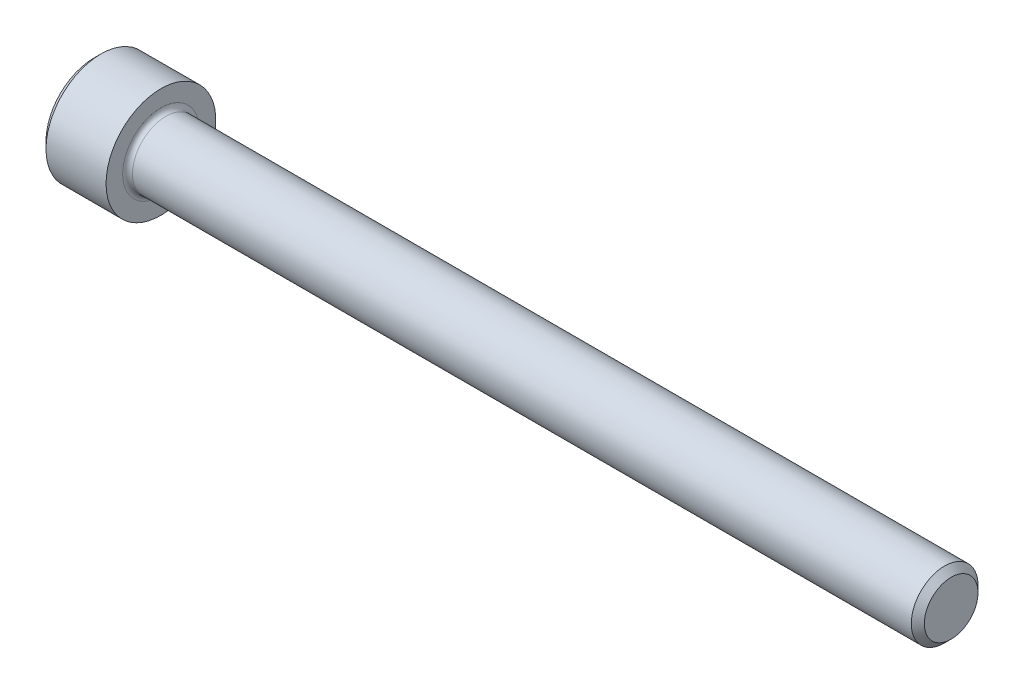
ISO-10303-21;
HEADER;
FILE_DESCRIPTION(('STEP AP214'),'2;1');
FILE_NAME('part.step','',(''),(''),'','','');
FILE_SCHEMA(('AUTOMOTIVE_DESIGN { 1 0 10303 214 1 1 1 1 }'));
ENDSEC;
DATA;
#1=APPLICATION_CONTEXT('core data for automotive mechanical design processes');
#2=APPLICATION_PROTOCOL_DEFINITION('international standard','automotive_design',2000,#1);
#3=PRODUCT_CONTEXT('',#1,'mechanical');
#4=PRODUCT('Part','Part','',(#3));
#5=PRODUCT_RELATED_PRODUCT_CATEGORY('part','',(#4));
#6=PRODUCT_DEFINITION_FORMATION('','',#4);
#7=PRODUCT_DEFINITION_CONTEXT('part definition',#1,'design');
#8=PRODUCT_DEFINITION('design','',#6,#7);
#9=PRODUCT_DEFINITION_SHAPE('','',#8);
#10=(LENGTH_UNIT() NAMED_UNIT(*) SI_UNIT(.MILLI.,.METRE.));
#11=(NAMED_UNIT(*) PLANE_ANGLE_UNIT() SI_UNIT($,.RADIAN.));
#12=(NAMED_UNIT(*) SI_UNIT($,.STERADIAN.) SOLID_ANGLE_UNIT());
#13=UNCERTAINTY_MEASURE_WITH_UNIT(LENGTH_MEASURE(1.E-05),#10,'distance_accuracy_value','');
#14=(GEOMETRIC_REPRESENTATION_CONTEXT(3) GLOBAL_UNCERTAINTY_ASSIGNED_CONTEXT((#13)) GLOBAL_UNIT_ASSIGNED_CONTEXT((#10,
#11,#12)) REPRESENTATION_CONTEXT('',''));
#15=CARTESIAN_POINT('',(0.,0.,0.));
#16=DIRECTION('',(0.,0.,1.));
#17=DIRECTION('',(1.,0.,0.));
#18=AXIS2_PLACEMENT_3D('',#15,#16,#17);
#19=CARTESIAN_POINT('',(2.286,1.14604605784412,1.98501000000003));
#20=DIRECTION('',(-1.,0.,0.));
#21=DIRECTION('',(0.,0.,1.));
#22=AXIS2_PLACEMENT_3D('',#19,#20,#21);
#23=PLANE('',#22);
#24=DIRECTION('',(0.,0.499999999999999,0.866025403784439));
#25=VECTOR('',#24,1.);
#26=CARTESIAN_POINT('',(2.286,-1.71906908676612,0.992505000000032));
#27=LINE('',#26,#25);
#28=CARTESIAN_POINT('',(2.28600000001322,-1.71906908676548,0.992504999999662));
#29=VERTEX_POINT('',#28);
#30=CARTESIAN_POINT('',(2.286,-1.14604605784409,1.98501));
#31=VERTEX_POINT('',#30);
#32=EDGE_CURVE('E99',#29,#31,#27,.T.);
#33=ORIENTED_EDGE('',*,*,#32,.T.);
#34=DIRECTION('',(0.,1.,0.));
#35=VECTOR('',#34,1.);
#36=CARTESIAN_POINT('',(2.286,1.14604605784412,1.98501));
#37=LINE('',#36,#35);
#38=CARTESIAN_POINT('',(2.28599999999801,0.,1.98501000002693));
#39=VERTEX_POINT('',#38);
#40=EDGE_CURVE('E94',#31,#39,#37,.T.);
#41=ORIENTED_EDGE('',*,*,#40,.T.);
#42=CARTESIAN_POINT('',(2.28600000002643,0.,0.));
#43=DIRECTION('',(-1.,0.,0.));
#44=DIRECTION('',(0.,0.,1.));
#45=AXIS2_PLACEMENT_3D('',#42,#43,#44);
#46=CIRCLE('',#45,1.98500999999851);
#47=EDGE_CURVE('E96',#39,#29,#46,.F.);
#48=ORIENTED_EDGE('',*,*,#47,.T.);
#49=EDGE_LOOP('',(#33,#41,#48));
#50=FACE_BOUND('',#49,.T.);
#51=ADVANCED_FACE('F16',(#50),#23,.T.);
#52=CARTESIAN_POINT('',(2.286,1.14604605784412,1.98501000000003));
#53=DIRECTION('',(-1.,0.,0.));
#54=DIRECTION('',(0.,0.,1.));
#55=AXIS2_PLACEMENT_3D('',#52,#53,#54);
#56=PLANE('',#55);
#57=DIRECTION('',(0.,-0.499999999999978,0.866025403784451));
#58=VECTOR('',#57,1.);
#59=CARTESIAN_POINT('',(2.286,-1.71906908676615,-0.992504999999998));
#60=LINE('',#59,#58);
#61=CARTESIAN_POINT('',(2.28600000001322,-1.7190690867655,-0.992504999999627));
#62=VERTEX_POINT('',#61);
#63=CARTESIAN_POINT('',(2.286,-2.2920921156882,0.));
#64=VERTEX_POINT('',#63);
#65=EDGE_CURVE('E103',#62,#64,#60,.T.);
#66=ORIENTED_EDGE('',*,*,#65,.T.);
#67=DIRECTION('',(0.,0.500000000000031,0.866025403784421));
#68=VECTOR('',#67,1.);
#69=CARTESIAN_POINT('',(2.286,-2.2920921156882,0.));
#70=LINE('',#69,#68);
#71=EDGE_CURVE('E170',#64,#29,#70,.T.);
#72=ORIENTED_EDGE('',*,*,#71,.T.);
#73=CARTESIAN_POINT('',(2.28600000002643,0.,0.));
#74=DIRECTION('',(-1.,0.,0.));
#75=DIRECTION('',(0.,0.,1.));
#76=AXIS2_PLACEMENT_3D('',#73,#74,#75);
#77=CIRCLE('',#76,1.98500999999851);
#78=EDGE_CURVE('E115',#29,#62,#77,.F.);
#79=ORIENTED_EDGE('',*,*,#78,.T.);
#80=EDGE_LOOP('',(#66,#72,#79));
#81=FACE_BOUND('',#80,.T.);
#82=ADVANCED_FACE('F227',(#81),#56,.T.);
#83=CARTESIAN_POINT('',(2.286,1.14604605784412,1.98501000000003));
#84=DIRECTION('',(-1.,0.,0.));
#85=DIRECTION('',(0.,0.,1.));
#86=AXIS2_PLACEMENT_3D('',#83,#84,#85);
#87=PLANE('',#86);
#88=DIRECTION('',(0.,1.,0.));
#89=VECTOR('',#88,1.);
#90=CARTESIAN_POINT('',(2.286,1.14604605784412,-1.98500999999998));
#91=LINE('',#90,#89);
#92=CARTESIAN_POINT('',(2.28600000002082,-3.05260855546239E-12,-1.98500999995698));
#93=VERTEX_POINT('',#92);
#94=CARTESIAN_POINT('',(2.286,-1.1460460578441,-1.98500999999998));
#95=VERTEX_POINT('',#94);
#96=EDGE_CURVE('E165',#93,#95,#91,.F.);
#97=ORIENTED_EDGE('',*,*,#96,.T.);
#98=DIRECTION('',(0.,-0.500000000000002,0.866025403784438));
#99=VECTOR('',#98,1.);
#100=CARTESIAN_POINT('',(2.286,-1.1460460578441,-1.98501));
#101=LINE('',#100,#99);
#102=EDGE_CURVE('E160',#95,#62,#101,.T.);
#103=ORIENTED_EDGE('',*,*,#102,.T.);
#104=CARTESIAN_POINT('',(2.28600000002643,0.,0.));
#105=DIRECTION('',(-1.,0.,0.));
#106=DIRECTION('',(0.,0.,1.));
#107=AXIS2_PLACEMENT_3D('',#104,#105,#106);
#108=CIRCLE('',#107,1.98500999999851);
#109=EDGE_CURVE('E223',#62,#93,#108,.F.);
#110=ORIENTED_EDGE('',*,*,#109,.T.);
#111=EDGE_LOOP('',(#97,#103,#110));
#112=FACE_BOUND('',#111,.T.);
#113=ADVANCED_FACE('F229',(#112),#87,.T.);
#114=CARTESIAN_POINT('',(2.286,1.14604605784412,1.98501000000003));
#115=DIRECTION('',(-1.,0.,0.));
#116=DIRECTION('',(0.,0.,1.));
#117=AXIS2_PLACEMENT_3D('',#114,#115,#116);
#118=PLANE('',#117);
#119=DIRECTION('',(0.,-0.499999999999991,-0.866025403784444));
#120=VECTOR('',#119,1.);
#121=CARTESIAN_POINT('',(2.286,1.71906908676615,-0.992504999999987));
#122=LINE('',#121,#120);
#123=CARTESIAN_POINT('',(2.28600000001321,1.71906908676551,-0.992504999999615));
#124=VERTEX_POINT('',#123);
#125=CARTESIAN_POINT('',(2.286,1.14604605784411,-1.98501));
#126=VERTEX_POINT('',#125);
#127=EDGE_CURVE('E155',#124,#126,#122,.T.);
#128=ORIENTED_EDGE('',*,*,#127,.T.);
#129=DIRECTION('',(0.,1.,0.));
#130=VECTOR('',#129,1.);
#131=CARTESIAN_POINT('',(2.286,1.14604605784412,-1.98501));
#132=LINE('',#131,#130);
#133=EDGE_CURVE('E150',#126,#93,#132,.F.);
#134=ORIENTED_EDGE('',*,*,#133,.T.);
#135=CARTESIAN_POINT('',(2.28600000002643,0.,0.));
#136=DIRECTION('',(-1.,0.,0.));
#137=DIRECTION('',(0.,0.,1.));
#138=AXIS2_PLACEMENT_3D('',#135,#136,#137);
#139=CIRCLE('',#138,1.98500999999851);
#140=EDGE_CURVE('E220',#93,#124,#139,.F.);
#141=ORIENTED_EDGE('',*,*,#140,.T.);
#142=EDGE_LOOP('',(#128,#134,#141));
#143=FACE_BOUND('',#142,.T.);
#144=ADVANCED_FACE('F234',(#143),#118,.T.);
#145=CARTESIAN_POINT('',(2.286,1.14604605784412,1.98501000000003));
#146=DIRECTION('',(-1.,0.,0.));
#147=DIRECTION('',(0.,0.,1.));
#148=AXIS2_PLACEMENT_3D('',#145,#146,#147);
#149=PLANE('',#148);
#150=DIRECTION('',(0.,0.500000000000002,-0.866025403784437));
#151=VECTOR('',#150,1.);
#152=CARTESIAN_POINT('',(2.286,1.71906908676615,0.992504999999998));
#153=LINE('',#152,#151);
#154=CARTESIAN_POINT('',(2.28600000001321,1.71906908676551,0.992504999999624));
#155=VERTEX_POINT('',#154);
#156=CARTESIAN_POINT('',(2.286,2.2920921156882,0.));
#157=VERTEX_POINT('',#156);
#158=EDGE_CURVE('E145',#155,#157,#153,.T.);
#159=ORIENTED_EDGE('',*,*,#158,.T.);
#160=DIRECTION('',(0.,-0.500000000000006,-0.866025403784435));
#161=VECTOR('',#160,1.);
#162=CARTESIAN_POINT('',(2.286,2.2920921156882,0.));
#163=LINE('',#162,#161);
#164=EDGE_CURVE('E116',#157,#124,#163,.T.);
#165=ORIENTED_EDGE('',*,*,#164,.T.);
#166=CARTESIAN_POINT('',(2.28600000002643,0.,0.));
#167=DIRECTION('',(-1.,0.,0.));
#168=DIRECTION('',(0.,0.,1.));
#169=AXIS2_PLACEMENT_3D('',#166,#167,#168);
#170=CIRCLE('',#169,1.98500999999851);
#171=EDGE_CURVE('E123',#124,#155,#170,.F.);
#172=ORIENTED_EDGE('',*,*,#171,.T.);
#173=EDGE_LOOP('',(#159,#165,#172));
#174=FACE_BOUND('',#173,.T.);
#175=ADVANCED_FACE('F236',(#174),#149,.T.);
#176=CARTESIAN_POINT('',(2.28600000002643,0.,0.));
#177=DIRECTION('',(-1.,0.,0.));
#178=DIRECTION('',(0.,0.,1.));
#179=AXIS2_PLACEMENT_3D('',#176,#177,#178);
#180=CONICAL_SURFACE('',#179,1.98500999999851,1.04719755110507);
#181=CARTESIAN_POINT('',(3.43204605775327,0.,1.70530256582424E-10));
#182=VERTEX_POINT('',#181);
#183=VERTEX_LOOP('',#182);
#184=FACE_BOUND('',#183,.T.);
#185=ORIENTED_EDGE('',*,*,#47,.F.);
#186=CARTESIAN_POINT('',(2.28600000002643,0.,0.));
#187=DIRECTION('',(-1.,0.,0.));
#188=DIRECTION('',(0.,0.,1.));
#189=AXIS2_PLACEMENT_3D('',#186,#187,#188);
#190=CIRCLE('',#189,1.98500999999851);
#191=EDGE_CURVE('E111',#155,#39,#190,.F.);
#192=ORIENTED_EDGE('',*,*,#191,.F.);
#193=ORIENTED_EDGE('',*,*,#171,.F.);
#194=ORIENTED_EDGE('',*,*,#140,.F.);
#195=ORIENTED_EDGE('',*,*,#109,.F.);
#196=ORIENTED_EDGE('',*,*,#78,.F.);
#197=EDGE_LOOP('',(#185,#192,#193,#194,#195,#196));
#198=FACE_BOUND('',#197,.T.);
#199=ADVANCED_FACE('F109',(#184,#198),#180,.F.);
#200=CARTESIAN_POINT('',(2.286,1.14604605784412,1.98501000000003));
#201=DIRECTION('',(-1.,0.,0.));
#202=DIRECTION('',(0.,0.,1.));
#203=AXIS2_PLACEMENT_3D('',#200,#201,#202);
#204=PLANE('',#203);
#205=DIRECTION('',(0.,-1.,0.));
#206=VECTOR('',#205,1.);
#207=CARTESIAN_POINT('',(2.286,-1.14604605784409,1.98501));
#208=LINE('',#207,#206);
#209=CARTESIAN_POINT('',(2.286,1.14604605784411,1.98501));
#210=VERTEX_POINT('',#209);
#211=EDGE_CURVE('E120',#39,#210,#208,.F.);
#212=ORIENTED_EDGE('',*,*,#211,.T.);
#213=DIRECTION('',(0.,0.500000000000002,-0.866025403784438));
#214=VECTOR('',#213,1.);
#215=CARTESIAN_POINT('',(2.286,2.2920921156882,0.));
#216=LINE('',#215,#214);
#217=EDGE_CURVE('E122',#155,#210,#216,.F.);
#218=ORIENTED_EDGE('',*,*,#217,.F.);
#219=ORIENTED_EDGE('',*,*,#191,.T.);
#220=EDGE_LOOP('',(#212,#218,#219));
#221=FACE_BOUND('',#220,.T.);
#222=ADVANCED_FACE('F119',(#221),#204,.T.);
#223=CARTESIAN_POINT('',(2.286,2.2920921156882,0.));
#224=DIRECTION('',(0.,-0.866025403784438,-0.500000000000002));
#225=DIRECTION('',(0.,0.500000000000002,-0.866025403784438));
#226=AXIS2_PLACEMENT_3D('',#223,#224,#225);
#227=PLANE('',#226);
#228=ORIENTED_EDGE('',*,*,#217,.T.);
#229=DIRECTION('',(1.,0.,0.));
#230=VECTOR('',#229,1.);
#231=CARTESIAN_POINT('',(2.286,1.14604605784412,1.98501));
#232=LINE('',#231,#230);
#233=CARTESIAN_POINT('',(0.,1.14604605784411,1.98501000000001));
#234=VERTEX_POINT('',#233);
#235=EDGE_CURVE('E128',#210,#234,#232,.F.);
#236=ORIENTED_EDGE('',*,*,#235,.T.);
#237=DIRECTION('',(0.,-0.499999999999992,0.866025403784443));
#238=VECTOR('',#237,1.);
#239=CARTESIAN_POINT('',(0.,2.2920921156882,0.));
#240=LINE('',#239,#238);
#241=CARTESIAN_POINT('',(0.,2.2920921156882,0.));
#242=VERTEX_POINT('',#241);
#243=EDGE_CURVE('E135',#242,#234,#240,.T.);
#244=ORIENTED_EDGE('',*,*,#243,.F.);
#245=DIRECTION('',(1.,0.,0.));
#246=VECTOR('',#245,1.);
#247=CARTESIAN_POINT('',(2.286,2.2920921156882,0.));
#248=LINE('',#247,#246);
#249=EDGE_CURVE('E185',#242,#157,#248,.T.);
#250=ORIENTED_EDGE('',*,*,#249,.T.);
#251=ORIENTED_EDGE('',*,*,#158,.F.);
#252=EDGE_LOOP('',(#228,#236,#244,#250,#251));
#253=FACE_BOUND('',#252,.T.);
#254=ADVANCED_FACE('F244',(#253),#227,.T.);
#255=CARTESIAN_POINT('',(2.286,-1.14604605784409,1.98501));
#256=DIRECTION('',(0.,0.,1.));
#257=DIRECTION('',(0.,-1.,0.));
#258=AXIS2_PLACEMENT_3D('',#255,#256,#257);
#259=PLANE('',#258);
#260=ORIENTED_EDGE('',*,*,#235,.F.);
#261=ORIENTED_EDGE('',*,*,#211,.F.);
#262=ORIENTED_EDGE('',*,*,#40,.F.);
#263=DIRECTION('',(1.,0.,0.));
#264=VECTOR('',#263,1.);
#265=CARTESIAN_POINT('',(2.286,-1.14604605784409,1.98501));
#266=LINE('',#265,#264);
#267=CARTESIAN_POINT('',(0.,-1.14604605784409,1.98501000000001));
#268=VERTEX_POINT('',#267);
#269=EDGE_CURVE('E130',#268,#31,#266,.T.);
#270=ORIENTED_EDGE('',*,*,#269,.F.);
#271=DIRECTION('',(0.,1.,0.));
#272=VECTOR('',#271,1.);
#273=CARTESIAN_POINT('',(0.,0.,1.98501000000002));
#274=LINE('',#273,#272);
#275=EDGE_CURVE('E248',#234,#268,#274,.F.);
#276=ORIENTED_EDGE('',*,*,#275,.F.);
#277=EDGE_LOOP('',(#260,#261,#262,#270,#276));
#278=FACE_BOUND('',#277,.T.);
#279=ADVANCED_FACE('F126',(#278),#259,.F.);
#280=CARTESIAN_POINT('',(2.286,-1.14604605784409,1.98501));
#281=DIRECTION('',(0.,0.866025403784437,-0.500000000000003));
#282=DIRECTION('',(0.,0.500000000000003,0.866025403784437));
#283=AXIS2_PLACEMENT_3D('',#280,#281,#282);
#284=PLANE('',#283);
#285=ORIENTED_EDGE('',*,*,#71,.F.);
#286=DIRECTION('',(1.,0.,0.));
#287=VECTOR('',#286,1.);
#288=CARTESIAN_POINT('',(2.286,-2.2920921156882,0.));
#289=LINE('',#288,#287);
#290=CARTESIAN_POINT('',(0.,-2.29209211568818,0.));
#291=VERTEX_POINT('',#290);
#292=EDGE_CURVE('E196',#291,#64,#289,.T.);
#293=ORIENTED_EDGE('',*,*,#292,.F.);
#294=DIRECTION('',(0.,-0.500000000000015,-0.86602540378443));
#295=VECTOR('',#294,1.);
#296=CARTESIAN_POINT('',(0.,-1.14604605784409,1.98501));
#297=LINE('',#296,#295);
#298=EDGE_CURVE('E249',#268,#291,#297,.T.);
#299=ORIENTED_EDGE('',*,*,#298,.F.);
#300=ORIENTED_EDGE('',*,*,#269,.T.);
#301=ORIENTED_EDGE('',*,*,#32,.F.);
#302=EDGE_LOOP('',(#285,#293,#299,#300,#301));
#303=FACE_BOUND('',#302,.T.);
#304=ADVANCED_FACE('F334',(#303),#284,.T.);
#305=CARTESIAN_POINT('',(2.286,-2.2920921156882,0.));
#306=DIRECTION('',(0.,0.866025403784437,0.500000000000002));
#307=DIRECTION('',(0.,-0.500000000000002,0.866025403784437));
#308=AXIS2_PLACEMENT_3D('',#305,#306,#307);
#309=PLANE('',#308);
#310=ORIENTED_EDGE('',*,*,#102,.F.);
#311=DIRECTION('',(1.,0.,0.));
#312=VECTOR('',#311,1.);
#313=CARTESIAN_POINT('',(2.286,-1.1460460578441,-1.98501));
#314=LINE('',#313,#312);
#315=CARTESIAN_POINT('',(0.,-1.14604605784408,-1.98500999999999));
#316=VERTEX_POINT('',#315);
#317=EDGE_CURVE('E189',#95,#316,#314,.F.);
#318=ORIENTED_EDGE('',*,*,#317,.T.);
#319=DIRECTION('',(0.,0.49999999999999,-0.866025403784444));
#320=VECTOR('',#319,1.);
#321=CARTESIAN_POINT('',(0.,-2.2920921156882,0.));
#322=LINE('',#321,#320);
#323=EDGE_CURVE('E251',#291,#316,#322,.T.);
#324=ORIENTED_EDGE('',*,*,#323,.F.);
#325=ORIENTED_EDGE('',*,*,#292,.T.);
#326=ORIENTED_EDGE('',*,*,#65,.F.);
#327=EDGE_LOOP('',(#310,#318,#324,#325,#326));
#328=FACE_BOUND('',#327,.T.);
#329=ADVANCED_FACE('F330',(#328),#309,.T.);
#330=CARTESIAN_POINT('',(2.286,1.14604605784411,-1.98501));
#331=DIRECTION('',(0.,0.,-1.));
#332=DIRECTION('',(0.,1.,0.));
#333=AXIS2_PLACEMENT_3D('',#330,#331,#332);
#334=PLANE('',#333);
#335=ORIENTED_EDGE('',*,*,#317,.F.);
#336=ORIENTED_EDGE('',*,*,#96,.F.);
#337=ORIENTED_EDGE('',*,*,#133,.F.);
#338=DIRECTION('',(1.,0.,0.));
#339=VECTOR('',#338,1.);
#340=CARTESIAN_POINT('',(2.286,1.1460460578441,-1.98501));
#341=LINE('',#340,#339);
#342=CARTESIAN_POINT('',(0.,1.14604605784411,-1.98501));
#343=VERTEX_POINT('',#342);
#344=EDGE_CURVE('E188',#126,#343,#341,.F.);
#345=ORIENTED_EDGE('',*,*,#344,.T.);
#346=DIRECTION('',(0.,1.,0.));
#347=VECTOR('',#346,1.);
#348=CARTESIAN_POINT('',(0.,0.,-1.98501));
#349=LINE('',#348,#347);
#350=EDGE_CURVE('E256',#316,#343,#349,.T.);
#351=ORIENTED_EDGE('',*,*,#350,.F.);
#352=EDGE_LOOP('',(#335,#336,#337,#345,#351));
#353=FACE_BOUND('',#352,.T.);
#354=ADVANCED_FACE('F327',(#353),#334,.F.);
#355=CARTESIAN_POINT('',(2.286,2.2920921156882,0.));
#356=DIRECTION('',(0.,0.866025403784437,-0.500000000000003));
#357=DIRECTION('',(0.,0.500000000000003,0.866025403784437));
#358=AXIS2_PLACEMENT_3D('',#355,#356,#357);
#359=PLANE('',#358);
#360=ORIENTED_EDGE('',*,*,#344,.F.);
#361=ORIENTED_EDGE('',*,*,#127,.F.);
#362=ORIENTED_EDGE('',*,*,#164,.F.);
#363=ORIENTED_EDGE('',*,*,#249,.F.);
#364=DIRECTION('',(0.,0.499999999999998,0.86602540378444));
#365=VECTOR('',#364,1.);
#366=CARTESIAN_POINT('',(0.,1.14604605784411,-1.98501));
#367=LINE('',#366,#365);
#368=EDGE_CURVE('E216',#343,#242,#367,.T.);
#369=ORIENTED_EDGE('',*,*,#368,.F.);
#370=EDGE_LOOP('',(#360,#361,#362,#363,#369));
#371=FACE_BOUND('',#370,.T.);
#372=ADVANCED_FACE('F240',(#371),#359,.F.);
#373=CARTESIAN_POINT('',(0.,0.,0.));
#374=DIRECTION('',(-1.,0.,0.));
#375=DIRECTION('',(0.,0.,1.));
#376=AXIS2_PLACEMENT_3D('',#373,#374,#375);
#377=PLANE('',#376);
#378=CARTESIAN_POINT('',(0.,0.,0.));
#379=DIRECTION('',(1.,0.,0.));
#380=DIRECTION('',(0.,0.,-1.));
#381=AXIS2_PLACEMENT_3D('',#378,#379,#380);
#382=CIRCLE('',#381,3.48615000001473);
#383=CARTESIAN_POINT('',(0.,0.,-3.48615000001473));
#384=VERTEX_POINT('',#383);
#385=EDGE_CURVE('E213',#384,#384,#382,.T.);
#386=ORIENTED_EDGE('',*,*,#385,.F.);
#387=EDGE_LOOP('',(#386));
#388=FACE_BOUND('',#387,.T.);
#389=ORIENTED_EDGE('',*,*,#350,.T.);
#390=ORIENTED_EDGE('',*,*,#368,.T.);
#391=ORIENTED_EDGE('',*,*,#243,.T.);
#392=ORIENTED_EDGE('',*,*,#275,.T.);
#393=ORIENTED_EDGE('',*,*,#298,.T.);
#394=ORIENTED_EDGE('',*,*,#323,.T.);
#395=EDGE_LOOP('',(#389,#390,#391,#392,#393,#394));
#396=FACE_BOUND('',#395,.T.);
#397=ADVANCED_FACE('F320',(#388,#396),#377,.T.);
#398=CARTESIAN_POINT('',(0.482599999998003,0.,0.));
#399=DIRECTION('',(1.,0.,0.));
#400=DIRECTION('',(0.,0.,-1.));
#401=AXIS2_PLACEMENT_3D('',#398,#399,#400);
#402=CONICAL_SURFACE('',#401,3.96875000001273,0.785398163397448);
#403=ORIENTED_EDGE('',*,*,#385,.T.);
#404=EDGE_LOOP('',(#403));
#405=FACE_BOUND('',#404,.T.);
#406=CARTESIAN_POINT('',(0.4826,0.,0.));
#407=DIRECTION('',(-1.,0.,0.));
#408=DIRECTION('',(0.,0.,1.));
#409=AXIS2_PLACEMENT_3D('',#406,#407,#408);
#410=CIRCLE('',#409,3.96875);
#411=CARTESIAN_POINT('',(0.482600000000001,0.,3.96874999999999));
#412=VERTEX_POINT('',#411);
#413=EDGE_CURVE('E215',#412,#412,#410,.F.);
#414=ORIENTED_EDGE('',*,*,#413,.F.);
#415=EDGE_LOOP('',(#414));
#416=FACE_BOUND('',#415,.T.);
#417=ADVANCED_FACE('F316',(#405,#416),#402,.T.);
#418=CARTESIAN_POINT('',(-31.75,0.,0.));
#419=DIRECTION('',(-1.,0.,0.));
#420=DIRECTION('',(0.,0.,1.));
#421=AXIS2_PLACEMENT_3D('',#418,#419,#420);
#422=CYLINDRICAL_SURFACE('',#421,3.96875);
#423=CARTESIAN_POINT('',(4.826,0.,0.));
#424=DIRECTION('',(-1.,0.,0.));
#425=DIRECTION('',(0.,0.,1.));
#426=AXIS2_PLACEMENT_3D('',#423,#424,#425);
#427=CIRCLE('',#426,3.96875);
#428=CARTESIAN_POINT('',(4.82600000000001,0.,3.96874999999999));
#429=VERTEX_POINT('',#428);
#430=EDGE_CURVE('E210',#429,#429,#427,.F.);
#431=ORIENTED_EDGE('',*,*,#430,.F.);
#432=EDGE_LOOP('',(#431));
#433=FACE_BOUND('',#432,.T.);
#434=ORIENTED_EDGE('',*,*,#413,.T.);
#435=EDGE_LOOP('',(#434));
#436=FACE_BOUND('',#435,.T.);
#437=ADVANCED_FACE('F312',(#433,#436),#422,.T.);
#438=CARTESIAN_POINT('',(61.976,1.94056,0.));
#439=DIRECTION('',(1.,0.,0.));
#440=DIRECTION('',(0.,0.,-1.));
#441=AXIS2_PLACEMENT_3D('',#438,#439,#440);
#442=PLANE('',#441);
#443=CARTESIAN_POINT('',(61.9760000000156,0.,0.));
#444=DIRECTION('',(-1.,0.,0.));
#445=DIRECTION('',(0.,0.,1.));
#446=AXIS2_PLACEMENT_3D('',#443,#444,#445);
#447=CIRCLE('',#446,1.94055999998);
#448=CARTESIAN_POINT('',(61.9760000000156,0.,1.94055999998));
#449=VERTEX_POINT('',#448);
#450=EDGE_CURVE('E206',#449,#449,#447,.T.);
#451=ORIENTED_EDGE('',*,*,#450,.F.);
#452=EDGE_LOOP('',(#451));
#453=FACE_BOUND('',#452,.T.);
#454=ADVANCED_FACE('F300',(#453),#442,.T.);
#455=CARTESIAN_POINT('',(4.826,3.96875000000002,0.));
#456=DIRECTION('',(1.,0.,0.));
#457=DIRECTION('',(0.,0.,-1.));
#458=AXIS2_PLACEMENT_3D('',#455,#456,#457);
#459=PLANE('',#458);
#460=ORIENTED_EDGE('',*,*,#430,.T.);
#461=EDGE_LOOP('',(#460));
#462=FACE_BOUND('',#461,.T.);
#463=CARTESIAN_POINT('',(4.826,0.,0.));
#464=DIRECTION('',(1.,0.,0.));
#465=DIRECTION('',(0.,0.,1.));
#466=AXIS2_PLACEMENT_3D('',#463,#464,#465);
#467=CIRCLE('',#466,2.76859999999998);
#468=CARTESIAN_POINT('',(4.826,0.,-2.76859999999998));
#469=VERTEX_POINT('',#468);
#470=CARTESIAN_POINT('',(4.826,0.,2.76859999999998));
#471=VERTEX_POINT('',#470);
#472=EDGE_CURVE('E209',#469,#471,#467,.F.);
#473=ORIENTED_EDGE('',*,*,#472,.T.);
#474=CARTESIAN_POINT('',(4.826,0.,0.));
#475=DIRECTION('',(1.,0.,0.));
#476=DIRECTION('',(0.,0.,-1.));
#477=AXIS2_PLACEMENT_3D('',#474,#475,#476);
#478=CIRCLE('',#477,2.76859999999998);
#479=EDGE_CURVE('E35',#471,#469,#478,.F.);
#480=ORIENTED_EDGE('',*,*,#479,.T.);
#481=EDGE_LOOP('',(#473,#480));
#482=FACE_BOUND('',#481,.T.);
#483=ADVANCED_FACE('F291',(#462,#482),#459,.T.);
#484=CARTESIAN_POINT('',(61.5035599999487,0.,0.));
#485=DIRECTION('',(-1.,0.,0.));
#486=DIRECTION('',(0.,0.,1.));
#487=AXIS2_PLACEMENT_3D('',#484,#485,#486);
#488=CONICAL_SURFACE('',#487,2.41300000004685,0.785398163397449);
#489=ORIENTED_EDGE('',*,*,#450,.T.);
#490=EDGE_LOOP('',(#489));
#491=FACE_BOUND('',#490,.T.);
#492=CARTESIAN_POINT('',(61.5035599999999,0.,0.));
#493=DIRECTION('',(-1.,0.,0.));
#494=DIRECTION('',(0.,0.,1.));
#495=AXIS2_PLACEMENT_3D('',#492,#493,#494);
#496=CIRCLE('',#495,2.41299999999998);
#497=CARTESIAN_POINT('',(61.5035599999999,0.,2.41299999999994));
#498=VERTEX_POINT('',#497);
#499=EDGE_CURVE('E27',#498,#498,#496,.T.);
#500=ORIENTED_EDGE('',*,*,#499,.F.);
#501=EDGE_LOOP('',(#500));
#502=FACE_BOUND('',#501,.T.);
#503=ADVANCED_FACE('F280',(#491,#502),#488,.T.);
#504=CARTESIAN_POINT('',(5.1816,0.,0.));
#505=DIRECTION('',(1.,0.,0.));
#506=DIRECTION('',(0.,0.,-1.));
#507=AXIS2_PLACEMENT_3D('',#504,#505,#506);
#508=TOROIDAL_SURFACE('',#507,2.76859999999998,0.3556);
#509=CARTESIAN_POINT('',(5.1816,0.,0.));
#510=DIRECTION('',(-1.,0.,0.));
#511=DIRECTION('',(0.,0.,1.));
#512=AXIS2_PLACEMENT_3D('',#509,#510,#511);
#513=CIRCLE('',#512,2.41299999999998);
#514=CARTESIAN_POINT('',(5.1816,0.,2.41299999999997));
#515=VERTEX_POINT('',#514);
#516=EDGE_CURVE('E11',#515,#515,#513,.F.);
#517=ORIENTED_EDGE('',*,*,#516,.F.);
#518=EDGE_LOOP('',(#517));
#519=FACE_BOUND('',#518,.T.);
#520=ORIENTED_EDGE('',*,*,#472,.F.);
#521=ORIENTED_EDGE('',*,*,#479,.F.);
#522=EDGE_LOOP('',(#520,#521));
#523=FACE_BOUND('',#522,.T.);
#524=ADVANCED_FACE('F268',(#519,#523),#508,.F.);
#525=CARTESIAN_POINT('',(-31.75,0.,0.));
#526=DIRECTION('',(-1.,0.,0.));
#527=DIRECTION('',(0.,0.,1.));
#528=AXIS2_PLACEMENT_3D('',#525,#526,#527);
#529=CYLINDRICAL_SURFACE('',#528,2.41299999999998);
#530=ORIENTED_EDGE('',*,*,#499,.T.);
#531=EDGE_LOOP('',(#530));
#532=FACE_BOUND('',#531,.T.);
#533=ORIENTED_EDGE('',*,*,#516,.T.);
#534=EDGE_LOOP('',(#533));
#535=FACE_BOUND('',#534,.T.);
#536=ADVANCED_FACE('F279',(#532,#535),#529,.T.);
#537=CLOSED_SHELL('',(#51,#82,#113,#144,#175,#199,#222,#254,#279,#304,#329,#354,#372,#397,#417,
#437,#454,#483,#503,#524,#536));
#538=MANIFOLD_SOLID_BREP('B1',#537);
#539=ADVANCED_BREP_SHAPE_REPRESENTATION('',(#18,#538),#14);
#540=SHAPE_DEFINITION_REPRESENTATION(#9,#539);
ENDSEC;
END-ISO-10303-21;
